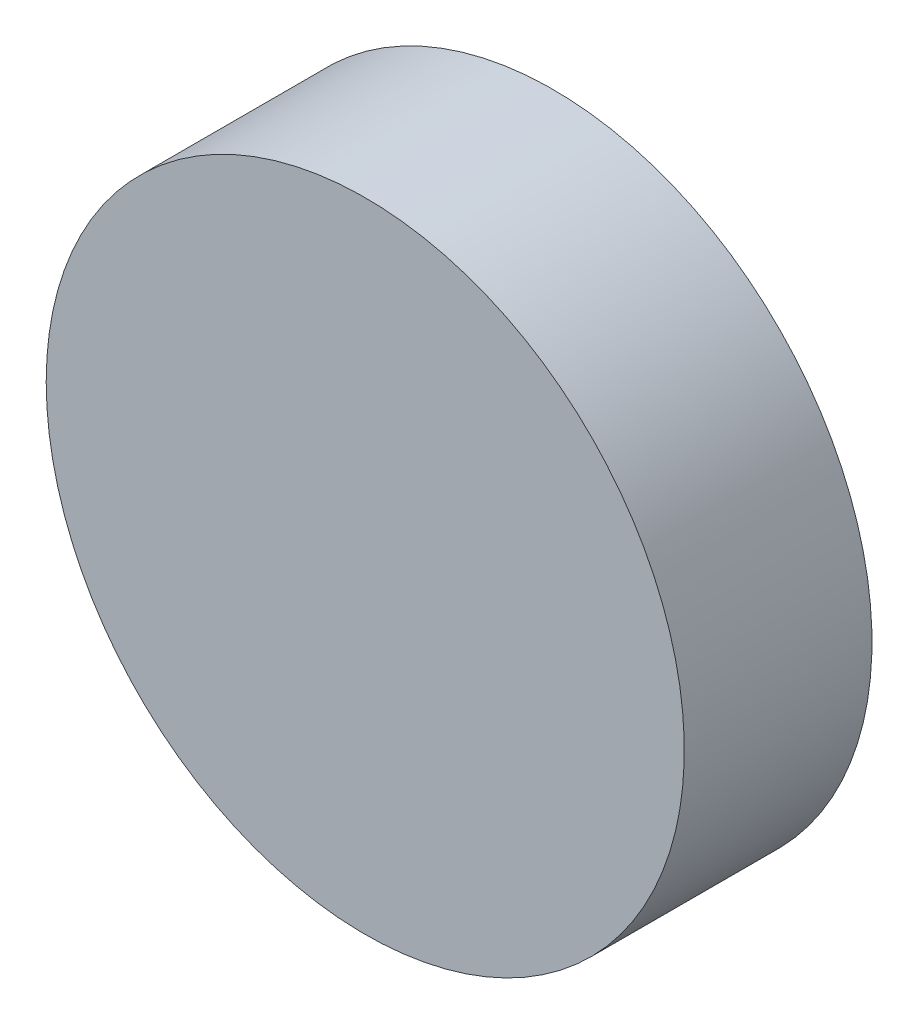
ISO-10303-21;
HEADER;
FILE_DESCRIPTION(('STEP AP214'),'2;1');
FILE_NAME('part.step','',(''),(''),'','','');
FILE_SCHEMA(('AUTOMOTIVE_DESIGN { 1 0 10303 214 1 1 1 1 }'));
ENDSEC;
DATA;
#1=APPLICATION_CONTEXT('core data for automotive mechanical design processes');
#2=APPLICATION_PROTOCOL_DEFINITION('international standard','automotive_design',2000,#1);
#3=PRODUCT_CONTEXT('',#1,'mechanical');
#4=PRODUCT('Part','Part','',(#3));
#5=PRODUCT_RELATED_PRODUCT_CATEGORY('part','',(#4));
#6=PRODUCT_DEFINITION_FORMATION('','',#4);
#7=PRODUCT_DEFINITION_CONTEXT('part definition',#1,'design');
#8=PRODUCT_DEFINITION('design','',#6,#7);
#9=PRODUCT_DEFINITION_SHAPE('','',#8);
#10=(LENGTH_UNIT() NAMED_UNIT(*) SI_UNIT(.MILLI.,.METRE.));
#11=(NAMED_UNIT(*) PLANE_ANGLE_UNIT() SI_UNIT($,.RADIAN.));
#12=(NAMED_UNIT(*) SI_UNIT($,.STERADIAN.) SOLID_ANGLE_UNIT());
#13=UNCERTAINTY_MEASURE_WITH_UNIT(LENGTH_MEASURE(1.E-05),#10,'distance_accuracy_value','');
#14=(GEOMETRIC_REPRESENTATION_CONTEXT(3) GLOBAL_UNCERTAINTY_ASSIGNED_CONTEXT((#13)) GLOBAL_UNIT_ASSIGNED_CONTEXT((#10,
#11,#12)) REPRESENTATION_CONTEXT('',''));
#15=CARTESIAN_POINT('',(0.,0.,0.));
#16=DIRECTION('',(0.,0.,1.));
#17=DIRECTION('',(1.,0.,0.));
#18=AXIS2_PLACEMENT_3D('',#15,#16,#17);
#19=CARTESIAN_POINT('',(1.2954,0.,0.));
#20=DIRECTION('',(0.,0.,-1.));
#21=DIRECTION('',(-1.,0.,0.));
#22=AXIS2_PLACEMENT_3D('',#19,#20,#21);
#23=PLANE('',#22);
#24=CARTESIAN_POINT('',(0.,0.,0.));
#25=DIRECTION('',(0.,0.,-1.));
#26=DIRECTION('',(-1.,0.,0.));
#27=AXIS2_PLACEMENT_3D('',#24,#25,#26);
#28=CIRCLE('',#27,1.2954);
#29=CARTESIAN_POINT('',(-1.2954,0.,0.));
#30=VERTEX_POINT('',#29);
#31=EDGE_CURVE('E18',#30,#30,#28,.F.);
#32=ORIENTED_EDGE('',*,*,#31,.F.);
#33=EDGE_LOOP('',(#32));
#34=FACE_BOUND('',#33,.T.);
#35=ADVANCED_FACE('F15',(#34),#23,.T.);
#36=CARTESIAN_POINT('',(1.2954,0.,0.762));
#37=DIRECTION('',(0.,0.,-1.));
#38=DIRECTION('',(-1.,0.,0.));
#39=AXIS2_PLACEMENT_3D('',#36,#37,#38);
#40=PLANE('',#39);
#41=CARTESIAN_POINT('',(0.,0.,0.762));
#42=DIRECTION('',(0.,0.,-1.));
#43=DIRECTION('',(-1.,0.,0.));
#44=AXIS2_PLACEMENT_3D('',#41,#42,#43);
#45=CIRCLE('',#44,1.2954);
#46=CARTESIAN_POINT('',(-1.2954,0.,0.762));
#47=VERTEX_POINT('',#46);
#48=EDGE_CURVE('E10',#47,#47,#45,.T.);
#49=ORIENTED_EDGE('',*,*,#48,.F.);
#50=EDGE_LOOP('',(#49));
#51=FACE_BOUND('',#50,.T.);
#52=ADVANCED_FACE('F30',(#51),#40,.F.);
#53=CARTESIAN_POINT('',(0.,0.,0.));
#54=DIRECTION('',(0.,0.,-1.));
#55=DIRECTION('',(-1.,0.,0.));
#56=AXIS2_PLACEMENT_3D('',#53,#54,#55);
#57=CYLINDRICAL_SURFACE('',#56,1.2954);
#58=ORIENTED_EDGE('',*,*,#31,.T.);
#59=EDGE_LOOP('',(#58));
#60=FACE_BOUND('',#59,.T.);
#61=ORIENTED_EDGE('',*,*,#48,.T.);
#62=EDGE_LOOP('',(#61));
#63=FACE_BOUND('',#62,.T.);
#64=ADVANCED_FACE('F27',(#60,#63),#57,.T.);
#65=CLOSED_SHELL('',(#35,#52,#64));
#66=MANIFOLD_SOLID_BREP('B1',#65);
#67=ADVANCED_BREP_SHAPE_REPRESENTATION('',(#18,#66),#14);
#68=SHAPE_DEFINITION_REPRESENTATION(#9,#67);
ENDSEC;
END-ISO-10303-21;
